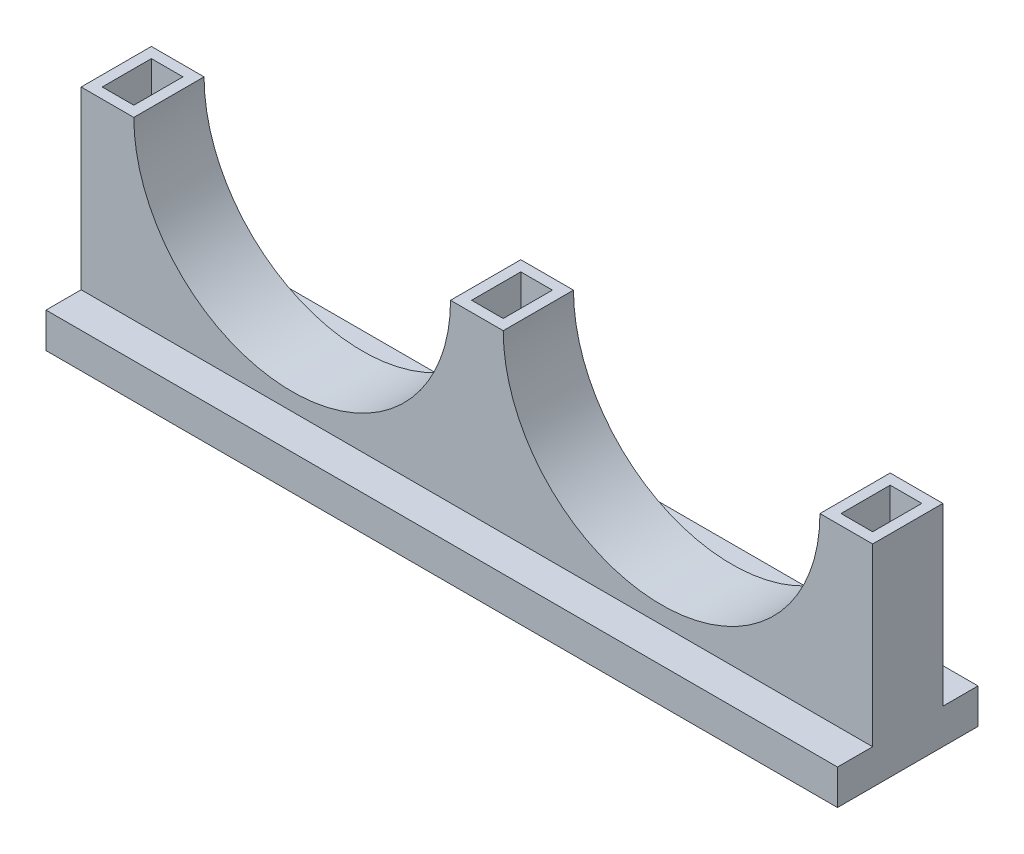
ISO-10303-21;
HEADER;
FILE_DESCRIPTION(('STEP AP214'),'2;1');
FILE_NAME('part.step','',(''),(''),'','','');
FILE_SCHEMA(('AUTOMOTIVE_DESIGN { 1 0 10303 214 1 1 1 1 }'));
ENDSEC;
DATA;
#1=APPLICATION_CONTEXT('core data for automotive mechanical design processes');
#2=APPLICATION_PROTOCOL_DEFINITION('international standard','automotive_design',2000,#1);
#3=PRODUCT_CONTEXT('',#1,'mechanical');
#4=PRODUCT('Part','Part','',(#3));
#5=PRODUCT_RELATED_PRODUCT_CATEGORY('part','',(#4));
#6=PRODUCT_DEFINITION_FORMATION('','',#4);
#7=PRODUCT_DEFINITION_CONTEXT('part definition',#1,'design');
#8=PRODUCT_DEFINITION('design','',#6,#7);
#9=PRODUCT_DEFINITION_SHAPE('','',#8);
#10=(LENGTH_UNIT() NAMED_UNIT(*) SI_UNIT(.MILLI.,.METRE.));
#11=(NAMED_UNIT(*) PLANE_ANGLE_UNIT() SI_UNIT($,.RADIAN.));
#12=(NAMED_UNIT(*) SI_UNIT($,.STERADIAN.) SOLID_ANGLE_UNIT());
#13=UNCERTAINTY_MEASURE_WITH_UNIT(LENGTH_MEASURE(1.E-05),#10,'distance_accuracy_value','');
#14=(GEOMETRIC_REPRESENTATION_CONTEXT(3) GLOBAL_UNCERTAINTY_ASSIGNED_CONTEXT((#13)) GLOBAL_UNIT_ASSIGNED_CONTEXT((#10,
#11,#12)) REPRESENTATION_CONTEXT('',''));
#15=CARTESIAN_POINT('',(0.,0.,0.));
#16=DIRECTION('',(0.,0.,1.));
#17=DIRECTION('',(1.,0.,0.));
#18=AXIS2_PLACEMENT_3D('',#15,#16,#17);
#19=CARTESIAN_POINT('',(0.,0.,20.));
#20=DIRECTION('',(0.,1.,0.));
#21=DIRECTION('',(0.,0.,1.));
#22=AXIS2_PLACEMENT_3D('',#19,#20,#21);
#23=PLANE('',#22);
#24=DIRECTION('',(0.,0.,-1.));
#25=VECTOR('',#24,1.);
#26=CARTESIAN_POINT('',(0.,0.,20.));
#27=LINE('',#26,#25);
#28=CARTESIAN_POINT('',(0.,0.,30.));
#29=VERTEX_POINT('',#28);
#30=CARTESIAN_POINT('',(0.,0.,-10.));
#31=VERTEX_POINT('',#30);
#32=EDGE_CURVE('E53',#29,#31,#27,.T.);
#33=ORIENTED_EDGE('',*,*,#32,.T.);
#34=DIRECTION('',(1.,0.,0.));
#35=VECTOR('',#34,1.);
#36=CARTESIAN_POINT('',(225.34,0.,-10.));
#37=LINE('',#36,#35);
#38=CARTESIAN_POINT('',(225.34,0.,-10.));
#39=VERTEX_POINT('',#38);
#40=EDGE_CURVE('E215',#31,#39,#37,.T.);
#41=ORIENTED_EDGE('',*,*,#40,.T.);
#42=DIRECTION('',(0.,0.,-1.));
#43=VECTOR('',#42,1.);
#44=CARTESIAN_POINT('',(225.34,0.,20.));
#45=LINE('',#44,#43);
#46=CARTESIAN_POINT('',(225.34,0.,30.));
#47=VERTEX_POINT('',#46);
#48=EDGE_CURVE('E458',#47,#39,#45,.T.);
#49=ORIENTED_EDGE('',*,*,#48,.F.);
#50=DIRECTION('',(1.,0.,0.));
#51=VECTOR('',#50,1.);
#52=CARTESIAN_POINT('',(225.34,0.,30.));
#53=LINE('',#52,#51);
#54=EDGE_CURVE('E231',#29,#47,#53,.T.);
#55=ORIENTED_EDGE('',*,*,#54,.F.);
#56=EDGE_LOOP('',(#33,#41,#49,#55));
#57=FACE_BOUND('',#56,.T.);
#58=ADVANCED_FACE('F45',(#57),#23,.F.);
#59=CARTESIAN_POINT('',(225.34,60.,20.));
#60=DIRECTION('',(-1.,0.,0.));
#61=DIRECTION('',(0.,0.,1.));
#62=AXIS2_PLACEMENT_3D('',#59,#60,#61);
#63=PLANE('',#62);
#64=DIRECTION('',(0.,1.,0.));
#65=VECTOR('',#64,1.);
#66=CARTESIAN_POINT('',(225.34,60.,20.));
#67=LINE('',#66,#65);
#68=CARTESIAN_POINT('',(225.34,10.,20.));
#69=VERTEX_POINT('',#68);
#70=CARTESIAN_POINT('',(225.34,60.,20.));
#71=VERTEX_POINT('',#70);
#72=EDGE_CURVE('E211',#69,#71,#67,.T.);
#73=ORIENTED_EDGE('',*,*,#72,.F.);
#74=DIRECTION('',(0.,0.,1.));
#75=VECTOR('',#74,1.);
#76=CARTESIAN_POINT('',(225.34,10.,-10.));
#77=LINE('',#76,#75);
#78=CARTESIAN_POINT('',(225.34,10.,30.));
#79=VERTEX_POINT('',#78);
#80=EDGE_CURVE('E205',#69,#79,#77,.T.);
#81=ORIENTED_EDGE('',*,*,#80,.T.);
#82=DIRECTION('',(0.,1.,0.));
#83=VECTOR('',#82,1.);
#84=CARTESIAN_POINT('',(225.34,0.,30.));
#85=LINE('',#84,#83);
#86=EDGE_CURVE('E209',#47,#79,#85,.T.);
#87=ORIENTED_EDGE('',*,*,#86,.F.);
#88=ORIENTED_EDGE('',*,*,#48,.T.);
#89=DIRECTION('',(0.,1.,0.));
#90=VECTOR('',#89,1.);
#91=CARTESIAN_POINT('',(225.34,0.,-10.));
#92=LINE('',#91,#90);
#93=CARTESIAN_POINT('',(225.34,10.,-10.));
#94=VERTEX_POINT('',#93);
#95=EDGE_CURVE('E239',#39,#94,#92,.T.);
#96=ORIENTED_EDGE('',*,*,#95,.T.);
#97=CARTESIAN_POINT('',(225.34,10.,0.));
#98=VERTEX_POINT('',#97);
#99=EDGE_CURVE('E214',#94,#98,#77,.T.);
#100=ORIENTED_EDGE('',*,*,#99,.T.);
#101=DIRECTION('',(0.,1.,0.));
#102=VECTOR('',#101,1.);
#103=CARTESIAN_POINT('',(225.34,60.,0.));
#104=LINE('',#103,#102);
#105=CARTESIAN_POINT('',(225.34,60.,0.));
#106=VERTEX_POINT('',#105);
#107=EDGE_CURVE('E280',#98,#106,#104,.T.);
#108=ORIENTED_EDGE('',*,*,#107,.T.);
#109=DIRECTION('',(0.,0.,-1.));
#110=VECTOR('',#109,1.);
#111=CARTESIAN_POINT('',(225.34,60.,20.));
#112=LINE('',#111,#110);
#113=EDGE_CURVE('E454',#71,#106,#112,.T.);
#114=ORIENTED_EDGE('',*,*,#113,.F.);
#115=EDGE_LOOP('',(#73,#81,#87,#88,#96,#100,#108,#114));
#116=FACE_BOUND('',#115,.T.);
#117=ADVANCED_FACE('F207',(#116),#63,.F.);
#118=CARTESIAN_POINT('',(210.34,60.,20.));
#119=DIRECTION('',(0.,-1.,0.));
#120=DIRECTION('',(0.,0.,-1.));
#121=AXIS2_PLACEMENT_3D('',#118,#119,#120);
#122=PLANE('',#121);
#123=DIRECTION('',(1.,0.,0.));
#124=VECTOR('',#123,1.);
#125=CARTESIAN_POINT('',(213.34,59.9999999999999,17.));
#126=LINE('',#125,#124);
#127=CARTESIAN_POINT('',(213.34,60.,17.));
#128=VERTEX_POINT('',#127);
#129=CARTESIAN_POINT('',(222.34,59.9999999999999,17.));
#130=VERTEX_POINT('',#129);
#131=EDGE_CURVE('E344',#128,#130,#126,.T.);
#132=ORIENTED_EDGE('',*,*,#131,.F.);
#133=DIRECTION('',(0.,0.,1.));
#134=VECTOR('',#133,1.);
#135=CARTESIAN_POINT('',(213.34,59.9999999999999,3.));
#136=LINE('',#135,#134);
#137=CARTESIAN_POINT('',(213.34,59.9999999999999,3.));
#138=VERTEX_POINT('',#137);
#139=EDGE_CURVE('E264',#138,#128,#136,.T.);
#140=ORIENTED_EDGE('',*,*,#139,.F.);
#141=DIRECTION('',(-1.,0.,0.));
#142=VECTOR('',#141,1.);
#143=CARTESIAN_POINT('',(222.34,59.9999999999999,3.));
#144=LINE('',#143,#142);
#145=CARTESIAN_POINT('',(222.34,59.9999999999999,3.));
#146=VERTEX_POINT('',#145);
#147=EDGE_CURVE('E323',#146,#138,#144,.T.);
#148=ORIENTED_EDGE('',*,*,#147,.F.);
#149=DIRECTION('',(0.,0.,-1.));
#150=VECTOR('',#149,1.);
#151=CARTESIAN_POINT('',(222.34,59.9999999999999,17.));
#152=LINE('',#151,#150);
#153=EDGE_CURVE('E340',#130,#146,#152,.T.);
#154=ORIENTED_EDGE('',*,*,#153,.F.);
#155=EDGE_LOOP('',(#132,#140,#148,#154));
#156=FACE_BOUND('',#155,.T.);
#157=DIRECTION('',(-1.,0.,0.));
#158=VECTOR('',#157,1.);
#159=CARTESIAN_POINT('',(210.34,60.,0.));
#160=LINE('',#159,#158);
#161=CARTESIAN_POINT('',(210.34,60.,0.));
#162=VERTEX_POINT('',#161);
#163=EDGE_CURVE('E417',#106,#162,#160,.T.);
#164=ORIENTED_EDGE('',*,*,#163,.T.);
#165=DIRECTION('',(0.,0.,-1.));
#166=VECTOR('',#165,1.);
#167=CARTESIAN_POINT('',(210.34,60.,20.));
#168=LINE('',#167,#166);
#169=CARTESIAN_POINT('',(210.34,60.,20.));
#170=VERTEX_POINT('',#169);
#171=EDGE_CURVE('E450',#170,#162,#168,.T.);
#172=ORIENTED_EDGE('',*,*,#171,.F.);
#173=DIRECTION('',(-1.,0.,0.));
#174=VECTOR('',#173,1.);
#175=CARTESIAN_POINT('',(210.34,60.,20.));
#176=LINE('',#175,#174);
#177=EDGE_CURVE('E398',#71,#170,#176,.T.);
#178=ORIENTED_EDGE('',*,*,#177,.F.);
#179=ORIENTED_EDGE('',*,*,#113,.T.);
#180=EDGE_LOOP('',(#164,#172,#178,#179));
#181=FACE_BOUND('',#180,.T.);
#182=ADVANCED_FACE('F479',(#156,#181),#122,.F.);
#183=CARTESIAN_POINT('',(165.255,60.,20.));
#184=DIRECTION('',(0.,0.,-1.));
#185=DIRECTION('',(-1.,0.,0.));
#186=AXIS2_PLACEMENT_3D('',#183,#184,#185);
#187=CYLINDRICAL_SURFACE('',#186,45.085);
#188=CARTESIAN_POINT('',(165.255,60.,0.));
#189=DIRECTION('',(0.,0.,-1.));
#190=DIRECTION('',(1.,0.,0.));
#191=AXIS2_PLACEMENT_3D('',#188,#189,#190);
#192=CIRCLE('',#191,45.085);
#193=CARTESIAN_POINT('',(120.17,60.,0.));
#194=VERTEX_POINT('',#193);
#195=EDGE_CURVE('E420',#162,#194,#192,.T.);
#196=ORIENTED_EDGE('',*,*,#195,.T.);
#197=DIRECTION('',(0.,0.,-1.));
#198=VECTOR('',#197,1.);
#199=CARTESIAN_POINT('',(120.17,60.,20.));
#200=LINE('',#199,#198);
#201=CARTESIAN_POINT('',(120.17,60.,20.));
#202=VERTEX_POINT('',#201);
#203=EDGE_CURVE('E446',#202,#194,#200,.T.);
#204=ORIENTED_EDGE('',*,*,#203,.F.);
#205=CARTESIAN_POINT('',(165.255,60.,20.));
#206=DIRECTION('',(0.,0.,-1.));
#207=DIRECTION('',(1.,0.,0.));
#208=AXIS2_PLACEMENT_3D('',#205,#206,#207);
#209=CIRCLE('',#208,45.085);
#210=EDGE_CURVE('E401',#170,#202,#209,.T.);
#211=ORIENTED_EDGE('',*,*,#210,.F.);
#212=ORIENTED_EDGE('',*,*,#171,.T.);
#213=EDGE_LOOP('',(#196,#204,#211,#212));
#214=FACE_BOUND('',#213,.T.);
#215=ADVANCED_FACE('F483',(#214),#187,.F.);
#216=CARTESIAN_POINT('',(105.17,60.,20.));
#217=DIRECTION('',(0.,-1.,0.));
#218=DIRECTION('',(0.,0.,-1.));
#219=AXIS2_PLACEMENT_3D('',#216,#217,#218);
#220=PLANE('',#219);
#221=DIRECTION('',(1.,0.,0.));
#222=VECTOR('',#221,1.);
#223=CARTESIAN_POINT('',(108.17,60.,17.));
#224=LINE('',#223,#222);
#225=CARTESIAN_POINT('',(108.17,60.,17.));
#226=VERTEX_POINT('',#225);
#227=CARTESIAN_POINT('',(117.17,60.,17.));
#228=VERTEX_POINT('',#227);
#229=EDGE_CURVE('E386',#226,#228,#224,.T.);
#230=ORIENTED_EDGE('',*,*,#229,.F.);
#231=DIRECTION('',(0.,0.,1.));
#232=VECTOR('',#231,1.);
#233=CARTESIAN_POINT('',(108.17,60.,3.));
#234=LINE('',#233,#232);
#235=CARTESIAN_POINT('',(108.17,60.,3.));
#236=VERTEX_POINT('',#235);
#237=EDGE_CURVE('E336',#236,#226,#234,.T.);
#238=ORIENTED_EDGE('',*,*,#237,.F.);
#239=DIRECTION('',(-1.,0.,0.));
#240=VECTOR('',#239,1.);
#241=CARTESIAN_POINT('',(117.17,60.,3.));
#242=LINE('',#241,#240);
#243=CARTESIAN_POINT('',(117.17,60.,3.));
#244=VERTEX_POINT('',#243);
#245=EDGE_CURVE('E367',#244,#236,#242,.T.);
#246=ORIENTED_EDGE('',*,*,#245,.F.);
#247=DIRECTION('',(0.,0.,-1.));
#248=VECTOR('',#247,1.);
#249=CARTESIAN_POINT('',(117.17,60.,17.));
#250=LINE('',#249,#248);
#251=EDGE_CURVE('E382',#228,#244,#250,.T.);
#252=ORIENTED_EDGE('',*,*,#251,.F.);
#253=EDGE_LOOP('',(#230,#238,#246,#252));
#254=FACE_BOUND('',#253,.T.);
#255=DIRECTION('',(-1.,0.,0.));
#256=VECTOR('',#255,1.);
#257=CARTESIAN_POINT('',(105.17,60.,0.));
#258=LINE('',#257,#256);
#259=CARTESIAN_POINT('',(105.17,60.,0.));
#260=VERTEX_POINT('',#259);
#261=EDGE_CURVE('E423',#194,#260,#258,.T.);
#262=ORIENTED_EDGE('',*,*,#261,.T.);
#263=DIRECTION('',(0.,0.,-1.));
#264=VECTOR('',#263,1.);
#265=CARTESIAN_POINT('',(105.17,60.,20.));
#266=LINE('',#265,#264);
#267=CARTESIAN_POINT('',(105.17,60.,20.));
#268=VERTEX_POINT('',#267);
#269=EDGE_CURVE('E442',#268,#260,#266,.T.);
#270=ORIENTED_EDGE('',*,*,#269,.F.);
#271=DIRECTION('',(-1.,0.,0.));
#272=VECTOR('',#271,1.);
#273=CARTESIAN_POINT('',(105.17,60.,20.));
#274=LINE('',#273,#272);
#275=EDGE_CURVE('E404',#202,#268,#274,.T.);
#276=ORIENTED_EDGE('',*,*,#275,.F.);
#277=ORIENTED_EDGE('',*,*,#203,.T.);
#278=EDGE_LOOP('',(#262,#270,#276,#277));
#279=FACE_BOUND('',#278,.T.);
#280=ADVANCED_FACE('F491',(#254,#279),#220,.F.);
#281=CARTESIAN_POINT('',(60.085,60.,20.));
#282=DIRECTION('',(0.,0.,-1.));
#283=DIRECTION('',(-1.,0.,0.));
#284=AXIS2_PLACEMENT_3D('',#281,#282,#283);
#285=CYLINDRICAL_SURFACE('',#284,45.085);
#286=CARTESIAN_POINT('',(60.085,60.,0.));
#287=DIRECTION('',(0.,0.,-1.));
#288=DIRECTION('',(1.,0.,0.));
#289=AXIS2_PLACEMENT_3D('',#286,#287,#288);
#290=CIRCLE('',#289,45.085);
#291=CARTESIAN_POINT('',(15.,60.,0.));
#292=VERTEX_POINT('',#291);
#293=EDGE_CURVE('E426',#260,#292,#290,.T.);
#294=ORIENTED_EDGE('',*,*,#293,.T.);
#295=DIRECTION('',(0.,0.,-1.));
#296=VECTOR('',#295,1.);
#297=CARTESIAN_POINT('',(15.,60.,20.));
#298=LINE('',#297,#296);
#299=CARTESIAN_POINT('',(15.,60.,20.));
#300=VERTEX_POINT('',#299);
#301=EDGE_CURVE('E438',#300,#292,#298,.T.);
#302=ORIENTED_EDGE('',*,*,#301,.F.);
#303=CARTESIAN_POINT('',(60.085,60.,20.));
#304=DIRECTION('',(0.,0.,-1.));
#305=DIRECTION('',(1.,0.,0.));
#306=AXIS2_PLACEMENT_3D('',#303,#304,#305);
#307=CIRCLE('',#306,45.085);
#308=EDGE_CURVE('E407',#268,#300,#307,.T.);
#309=ORIENTED_EDGE('',*,*,#308,.F.);
#310=ORIENTED_EDGE('',*,*,#269,.T.);
#311=EDGE_LOOP('',(#294,#302,#309,#310));
#312=FACE_BOUND('',#311,.T.);
#313=ADVANCED_FACE('F494',(#312),#285,.F.);
#314=CARTESIAN_POINT('',(0.,60.,20.));
#315=DIRECTION('',(0.,-1.,0.));
#316=DIRECTION('',(1.,0.,0.));
#317=AXIS2_PLACEMENT_3D('',#314,#315,#316);
#318=PLANE('',#317);
#319=DIRECTION('',(-1.,0.,0.));
#320=VECTOR('',#319,1.);
#321=CARTESIAN_POINT('',(12.,60.,3.));
#322=LINE('',#321,#320);
#323=CARTESIAN_POINT('',(12.,60.,3.));
#324=VERTEX_POINT('',#323);
#325=CARTESIAN_POINT('',(3.,60.,3.));
#326=VERTEX_POINT('',#325);
#327=EDGE_CURVE('E263',#324,#326,#322,.T.);
#328=ORIENTED_EDGE('',*,*,#327,.F.);
#329=DIRECTION('',(0.,0.,-1.));
#330=VECTOR('',#329,1.);
#331=CARTESIAN_POINT('',(12.,60.,17.));
#332=LINE('',#331,#330);
#333=CARTESIAN_POINT('',(12.,60.,17.));
#334=VERTEX_POINT('',#333);
#335=EDGE_CURVE('E260',#334,#324,#332,.T.);
#336=ORIENTED_EDGE('',*,*,#335,.F.);
#337=DIRECTION('',(1.,0.,0.));
#338=VECTOR('',#337,1.);
#339=CARTESIAN_POINT('',(3.,60.,17.));
#340=LINE('',#339,#338);
#341=CARTESIAN_POINT('',(3.,60.,17.));
#342=VERTEX_POINT('',#341);
#343=EDGE_CURVE('E272',#342,#334,#340,.T.);
#344=ORIENTED_EDGE('',*,*,#343,.F.);
#345=DIRECTION('',(0.,0.,1.));
#346=VECTOR('',#345,1.);
#347=CARTESIAN_POINT('',(3.,60.,3.));
#348=LINE('',#347,#346);
#349=EDGE_CURVE('E268',#326,#342,#348,.T.);
#350=ORIENTED_EDGE('',*,*,#349,.F.);
#351=EDGE_LOOP('',(#328,#336,#344,#350));
#352=FACE_BOUND('',#351,.T.);
#353=DIRECTION('',(-1.,0.,0.));
#354=VECTOR('',#353,1.);
#355=CARTESIAN_POINT('',(0.,60.,0.));
#356=LINE('',#355,#354);
#357=CARTESIAN_POINT('',(0.,60.,0.));
#358=VERTEX_POINT('',#357);
#359=EDGE_CURVE('E429',#292,#358,#356,.T.);
#360=ORIENTED_EDGE('',*,*,#359,.T.);
#361=DIRECTION('',(0.,0.,-1.));
#362=VECTOR('',#361,1.);
#363=CARTESIAN_POINT('',(0.,60.,20.));
#364=LINE('',#363,#362);
#365=CARTESIAN_POINT('',(0.,60.,20.));
#366=VERTEX_POINT('',#365);
#367=EDGE_CURVE('E414',#366,#358,#364,.T.);
#368=ORIENTED_EDGE('',*,*,#367,.F.);
#369=DIRECTION('',(-1.,0.,0.));
#370=VECTOR('',#369,1.);
#371=CARTESIAN_POINT('',(0.,60.,20.));
#372=LINE('',#371,#370);
#373=EDGE_CURVE('E410',#300,#366,#372,.T.);
#374=ORIENTED_EDGE('',*,*,#373,.F.);
#375=ORIENTED_EDGE('',*,*,#301,.T.);
#376=EDGE_LOOP('',(#360,#368,#374,#375));
#377=FACE_BOUND('',#376,.T.);
#378=ADVANCED_FACE('F499',(#352,#377),#318,.F.);
#379=CARTESIAN_POINT('',(0.,10.,20.));
#380=DIRECTION('',(1.,0.,0.));
#381=DIRECTION('',(0.,0.,-1.));
#382=AXIS2_PLACEMENT_3D('',#379,#380,#381);
#383=PLANE('',#382);
#384=DIRECTION('',(0.,-1.,0.));
#385=VECTOR('',#384,1.);
#386=CARTESIAN_POINT('',(0.,10.,0.));
#387=LINE('',#386,#385);
#388=CARTESIAN_POINT('',(0.,9.99999999999999,0.));
#389=VERTEX_POINT('',#388);
#390=EDGE_CURVE('E395',#358,#389,#387,.T.);
#391=ORIENTED_EDGE('',*,*,#390,.T.);
#392=DIRECTION('',(0.,0.,1.));
#393=VECTOR('',#392,1.);
#394=CARTESIAN_POINT('',(0.,9.99999999999997,-10.));
#395=LINE('',#394,#393);
#396=CARTESIAN_POINT('',(0.,9.99999999999997,-10.));
#397=VERTEX_POINT('',#396);
#398=EDGE_CURVE('E68',#397,#389,#395,.T.);
#399=ORIENTED_EDGE('',*,*,#398,.F.);
#400=DIRECTION('',(0.,-1.,0.));
#401=VECTOR('',#400,1.);
#402=CARTESIAN_POINT('',(0.,0.,-10.));
#403=LINE('',#402,#401);
#404=EDGE_CURVE('E246',#397,#31,#403,.T.);
#405=ORIENTED_EDGE('',*,*,#404,.T.);
#406=ORIENTED_EDGE('',*,*,#32,.F.);
#407=DIRECTION('',(0.,-1.,0.));
#408=VECTOR('',#407,1.);
#409=CARTESIAN_POINT('',(0.,0.,30.));
#410=LINE('',#409,#408);
#411=CARTESIAN_POINT('',(0.,9.99999999999997,30.));
#412=VERTEX_POINT('',#411);
#413=EDGE_CURVE('E226',#412,#29,#410,.T.);
#414=ORIENTED_EDGE('',*,*,#413,.F.);
#415=CARTESIAN_POINT('',(0.,9.99999999999997,20.));
#416=VERTEX_POINT('',#415);
#417=EDGE_CURVE('E221',#416,#412,#395,.T.);
#418=ORIENTED_EDGE('',*,*,#417,.F.);
#419=DIRECTION('',(0.,-1.,0.));
#420=VECTOR('',#419,1.);
#421=CARTESIAN_POINT('',(0.,10.,20.));
#422=LINE('',#421,#420);
#423=EDGE_CURVE('E392',#366,#416,#422,.T.);
#424=ORIENTED_EDGE('',*,*,#423,.F.);
#425=ORIENTED_EDGE('',*,*,#367,.T.);
#426=EDGE_LOOP('',(#391,#399,#405,#406,#414,#418,#424,#425));
#427=FACE_BOUND('',#426,.T.);
#428=ADVANCED_FACE('F465',(#427),#383,.F.);
#429=CARTESIAN_POINT('',(165.255,60.,20.));
#430=DIRECTION('',(0.,0.,1.));
#431=DIRECTION('',(1.,0.,0.));
#432=AXIS2_PLACEMENT_3D('',#429,#430,#431);
#433=PLANE('',#432);
#434=DIRECTION('',(-1.,0.,0.));
#435=VECTOR('',#434,1.);
#436=CARTESIAN_POINT('',(165.255,9.99999999999999,20.));
#437=LINE('',#436,#435);
#438=EDGE_CURVE('E60',#69,#416,#437,.T.);
#439=ORIENTED_EDGE('',*,*,#438,.F.);
#440=ORIENTED_EDGE('',*,*,#72,.T.);
#441=ORIENTED_EDGE('',*,*,#177,.T.);
#442=ORIENTED_EDGE('',*,*,#210,.T.);
#443=ORIENTED_EDGE('',*,*,#275,.T.);
#444=ORIENTED_EDGE('',*,*,#308,.T.);
#445=ORIENTED_EDGE('',*,*,#373,.T.);
#446=ORIENTED_EDGE('',*,*,#423,.T.);
#447=EDGE_LOOP('',(#439,#440,#441,#442,#443,#444,#445,#446));
#448=FACE_BOUND('',#447,.T.);
#449=ADVANCED_FACE('F486',(#448),#433,.T.);
#450=CARTESIAN_POINT('',(165.255,60.,0.));
#451=DIRECTION('',(0.,0.,1.));
#452=DIRECTION('',(1.,0.,0.));
#453=AXIS2_PLACEMENT_3D('',#450,#451,#452);
#454=PLANE('',#453);
#455=ORIENTED_EDGE('',*,*,#107,.F.);
#456=DIRECTION('',(-1.,0.,0.));
#457=VECTOR('',#456,1.);
#458=CARTESIAN_POINT('',(165.255,9.99999999999999,0.));
#459=LINE('',#458,#457);
#460=EDGE_CURVE('E11',#98,#389,#459,.T.);
#461=ORIENTED_EDGE('',*,*,#460,.T.);
#462=ORIENTED_EDGE('',*,*,#390,.F.);
#463=ORIENTED_EDGE('',*,*,#359,.F.);
#464=ORIENTED_EDGE('',*,*,#293,.F.);
#465=ORIENTED_EDGE('',*,*,#261,.F.);
#466=ORIENTED_EDGE('',*,*,#195,.F.);
#467=ORIENTED_EDGE('',*,*,#163,.F.);
#468=EDGE_LOOP('',(#455,#461,#462,#463,#464,#465,#466,#467));
#469=FACE_BOUND('',#468,.T.);
#470=ADVANCED_FACE('F473',(#469),#454,.F.);
#471=CARTESIAN_POINT('',(12.,60.,17.));
#472=DIRECTION('',(0.999847695156391,-0.017452406437284,0.));
#473=DIRECTION('',(0.017452406437284,0.999847695156391,0.));
#474=AXIS2_PLACEMENT_3D('',#471,#472,#473);
#475=PLANE('',#474);
#476=ORIENTED_EDGE('',*,*,#335,.T.);
#477=DIRECTION('',(0.0174497491606832,0.999695459881887,-0.0174497491606827));
#478=VECTOR('',#477,1.);
#479=CARTESIAN_POINT('',(11.9957370875592,59.7557779098318,3.00426291244079));
#480=LINE('',#479,#478);
#481=CARTESIAN_POINT('',(11.8254493507178,50.,3.17455064928218));
#482=VERTEX_POINT('',#481);
#483=EDGE_CURVE('E282',#482,#324,#480,.T.);
#484=ORIENTED_EDGE('',*,*,#483,.F.);
#485=DIRECTION('',(0.,0.,-1.));
#486=VECTOR('',#485,1.);
#487=CARTESIAN_POINT('',(11.8254493507178,50.,0.));
#488=LINE('',#487,#486);
#489=CARTESIAN_POINT('',(11.8254493507178,50.,16.8254493507178));
#490=VERTEX_POINT('',#489);
#491=EDGE_CURVE('E276',#490,#482,#488,.T.);
#492=ORIENTED_EDGE('',*,*,#491,.F.);
#493=DIRECTION('',(0.0174497491606832,0.999695459881887,0.0174497491606827));
#494=VECTOR('',#493,1.);
#495=CARTESIAN_POINT('',(11.9972595562881,59.8430000848919,16.9972595562881));
#496=LINE('',#495,#494);
#497=EDGE_CURVE('E277',#490,#334,#496,.T.);
#498=ORIENTED_EDGE('',*,*,#497,.T.);
#499=EDGE_LOOP('',(#476,#484,#492,#498));
#500=FACE_BOUND('',#499,.T.);
#501=ADVANCED_FACE('F563',(#500),#475,.F.);
#502=CARTESIAN_POINT('',(3.,60.,17.));
#503=DIRECTION('',(0.,-0.0174524064372835,0.999847695156391));
#504=DIRECTION('',(0.,-0.999847695156391,-0.0174524064372835));
#505=AXIS2_PLACEMENT_3D('',#502,#503,#504);
#506=PLANE('',#505);
#507=ORIENTED_EDGE('',*,*,#343,.T.);
#508=ORIENTED_EDGE('',*,*,#497,.F.);
#509=DIRECTION('',(1.,0.,0.));
#510=VECTOR('',#509,1.);
#511=CARTESIAN_POINT('',(0.,50.,16.8254493507178));
#512=LINE('',#511,#510);
#513=CARTESIAN_POINT('',(3.17455064928217,50.,16.8254493507178));
#514=VERTEX_POINT('',#513);
#515=EDGE_CURVE('E287',#514,#490,#512,.T.);
#516=ORIENTED_EDGE('',*,*,#515,.F.);
#517=DIRECTION('',(-0.0174497491606823,0.999695459881887,0.0174497491606827));
#518=VECTOR('',#517,1.);
#519=CARTESIAN_POINT('',(3.00426291244079,59.7557779098318,16.9957370875592));
#520=LINE('',#519,#518);
#521=EDGE_CURVE('E281',#514,#342,#520,.T.);
#522=ORIENTED_EDGE('',*,*,#521,.T.);
#523=EDGE_LOOP('',(#507,#508,#516,#522));
#524=FACE_BOUND('',#523,.T.);
#525=ADVANCED_FACE('F567',(#524),#506,.F.);
#526=CARTESIAN_POINT('',(3.,60.,3.));
#527=DIRECTION('',(-0.999847695156391,-0.0174524064372831,0.));
#528=DIRECTION('',(0.0174524064372831,-0.999847695156391,0.));
#529=AXIS2_PLACEMENT_3D('',#526,#527,#528);
#530=PLANE('',#529);
#531=ORIENTED_EDGE('',*,*,#349,.T.);
#532=ORIENTED_EDGE('',*,*,#521,.F.);
#533=DIRECTION('',(0.,0.,1.));
#534=VECTOR('',#533,1.);
#535=CARTESIAN_POINT('',(3.17455064928217,50.,0.));
#536=LINE('',#535,#534);
#537=CARTESIAN_POINT('',(3.17455064928217,50.,3.17455064928218));
#538=VERTEX_POINT('',#537);
#539=EDGE_CURVE('E299',#538,#514,#536,.T.);
#540=ORIENTED_EDGE('',*,*,#539,.F.);
#541=DIRECTION('',(-0.0174497491606823,0.999695459881887,-0.0174497491606827));
#542=VECTOR('',#541,1.);
#543=CARTESIAN_POINT('',(3.00274044371194,59.8430000848919,3.00274044371194));
#544=LINE('',#543,#542);
#545=EDGE_CURVE('E286',#538,#326,#544,.T.);
#546=ORIENTED_EDGE('',*,*,#545,.T.);
#547=EDGE_LOOP('',(#531,#532,#540,#546));
#548=FACE_BOUND('',#547,.T.);
#549=ADVANCED_FACE('F573',(#548),#530,.F.);
#550=CARTESIAN_POINT('',(12.,60.,3.));
#551=DIRECTION('',(0.,-0.0174524064372835,-0.999847695156391));
#552=DIRECTION('',(0.,0.999847695156391,-0.0174524064372835));
#553=AXIS2_PLACEMENT_3D('',#550,#551,#552);
#554=PLANE('',#553);
#555=ORIENTED_EDGE('',*,*,#327,.T.);
#556=ORIENTED_EDGE('',*,*,#545,.F.);
#557=DIRECTION('',(-1.,0.,0.));
#558=VECTOR('',#557,1.);
#559=CARTESIAN_POINT('',(0.,50.,3.17455064928218));
#560=LINE('',#559,#558);
#561=EDGE_CURVE('E295',#482,#538,#560,.T.);
#562=ORIENTED_EDGE('',*,*,#561,.F.);
#563=ORIENTED_EDGE('',*,*,#483,.T.);
#564=EDGE_LOOP('',(#555,#556,#562,#563));
#565=FACE_BOUND('',#564,.T.);
#566=ADVANCED_FACE('F580',(#565),#554,.F.);
#567=CARTESIAN_POINT('',(0.,50.,0.));
#568=DIRECTION('',(0.,1.,0.));
#569=DIRECTION('',(-1.,0.,0.));
#570=AXIS2_PLACEMENT_3D('',#567,#568,#569);
#571=PLANE('',#570);
#572=ORIENTED_EDGE('',*,*,#491,.T.);
#573=ORIENTED_EDGE('',*,*,#561,.T.);
#574=ORIENTED_EDGE('',*,*,#539,.T.);
#575=ORIENTED_EDGE('',*,*,#515,.T.);
#576=EDGE_LOOP('',(#572,#573,#574,#575));
#577=FACE_BOUND('',#576,.T.);
#578=ADVANCED_FACE('F578',(#577),#571,.T.);
#579=CARTESIAN_POINT('',(108.17,60.,3.));
#580=DIRECTION('',(-0.999847695156391,-0.0174524064372831,0.));
#581=DIRECTION('',(0.0174524064372831,-0.999847695156391,0.));
#582=AXIS2_PLACEMENT_3D('',#579,#580,#581);
#583=PLANE('',#582);
#584=ORIENTED_EDGE('',*,*,#237,.T.);
#585=DIRECTION('',(-0.0174497491606823,0.999695459881887,0.0174497491606827));
#586=VECTOR('',#585,1.);
#587=CARTESIAN_POINT('',(108.174262912441,59.7557779098318,16.9957370875592));
#588=LINE('',#587,#586);
#589=CARTESIAN_POINT('',(108.344550649282,50.,16.8254493507178));
#590=VERTEX_POINT('',#589);
#591=EDGE_CURVE('E363',#590,#226,#588,.T.);
#592=ORIENTED_EDGE('',*,*,#591,.F.);
#593=DIRECTION('',(0.,0.,1.));
#594=VECTOR('',#593,1.);
#595=CARTESIAN_POINT('',(108.344550649282,50.,0.));
#596=LINE('',#595,#594);
#597=CARTESIAN_POINT('',(108.344550649282,50.,3.17455064928218));
#598=VERTEX_POINT('',#597);
#599=EDGE_CURVE('E354',#598,#590,#596,.T.);
#600=ORIENTED_EDGE('',*,*,#599,.F.);
#601=DIRECTION('',(-0.0174497491606823,0.999695459881887,-0.0174497491606827));
#602=VECTOR('',#601,1.);
#603=CARTESIAN_POINT('',(108.172740443712,59.8430000848918,3.00274044371194));
#604=LINE('',#603,#602);
#605=EDGE_CURVE('E259',#598,#236,#604,.T.);
#606=ORIENTED_EDGE('',*,*,#605,.T.);
#607=EDGE_LOOP('',(#584,#592,#600,#606));
#608=FACE_BOUND('',#607,.T.);
#609=ADVANCED_FACE('F539',(#608),#583,.F.);
#610=CARTESIAN_POINT('',(117.17,60.,3.));
#611=DIRECTION('',(0.,-0.0174524064372835,-0.999847695156391));
#612=DIRECTION('',(0.,0.999847695156391,-0.0174524064372835));
#613=AXIS2_PLACEMENT_3D('',#610,#611,#612);
#614=PLANE('',#613);
#615=ORIENTED_EDGE('',*,*,#245,.T.);
#616=ORIENTED_EDGE('',*,*,#605,.F.);
#617=DIRECTION('',(-1.,0.,0.));
#618=VECTOR('',#617,1.);
#619=CARTESIAN_POINT('',(0.,50.,3.17455064928218));
#620=LINE('',#619,#618);
#621=CARTESIAN_POINT('',(116.995449350718,50.,3.17455064928218));
#622=VERTEX_POINT('',#621);
#623=EDGE_CURVE('E359',#622,#598,#620,.T.);
#624=ORIENTED_EDGE('',*,*,#623,.F.);
#625=DIRECTION('',(0.0174497491606832,0.999695459881887,-0.0174497491606827));
#626=VECTOR('',#625,1.);
#627=CARTESIAN_POINT('',(117.165737087559,59.7557779098318,3.00426291244079));
#628=LINE('',#627,#626);
#629=EDGE_CURVE('E368',#622,#244,#628,.T.);
#630=ORIENTED_EDGE('',*,*,#629,.T.);
#631=EDGE_LOOP('',(#615,#616,#624,#630));
#632=FACE_BOUND('',#631,.T.);
#633=ADVANCED_FACE('F542',(#632),#614,.F.);
#634=CARTESIAN_POINT('',(117.17,60.,17.));
#635=DIRECTION('',(0.999847695156391,-0.017452406437284,0.));
#636=DIRECTION('',(0.017452406437284,0.999847695156391,0.));
#637=AXIS2_PLACEMENT_3D('',#634,#635,#636);
#638=PLANE('',#637);
#639=ORIENTED_EDGE('',*,*,#251,.T.);
#640=ORIENTED_EDGE('',*,*,#629,.F.);
#641=DIRECTION('',(0.,0.,-1.));
#642=VECTOR('',#641,1.);
#643=CARTESIAN_POINT('',(116.995449350718,50.,0.));
#644=LINE('',#643,#642);
#645=CARTESIAN_POINT('',(116.995449350718,50.,16.8254493507178));
#646=VERTEX_POINT('',#645);
#647=EDGE_CURVE('E355',#646,#622,#644,.T.);
#648=ORIENTED_EDGE('',*,*,#647,.F.);
#649=DIRECTION('',(0.0174497491606832,0.999695459881887,0.0174497491606827));
#650=VECTOR('',#649,1.);
#651=CARTESIAN_POINT('',(117.167259556288,59.8430000848918,16.9972595562881));
#652=LINE('',#651,#650);
#653=EDGE_CURVE('E371',#646,#228,#652,.T.);
#654=ORIENTED_EDGE('',*,*,#653,.T.);
#655=EDGE_LOOP('',(#639,#640,#648,#654));
#656=FACE_BOUND('',#655,.T.);
#657=ADVANCED_FACE('F544',(#656),#638,.F.);
#658=CARTESIAN_POINT('',(108.17,60.,17.));
#659=DIRECTION('',(0.,-0.0174524064372835,0.999847695156391));
#660=DIRECTION('',(0.,-0.999847695156391,-0.0174524064372835));
#661=AXIS2_PLACEMENT_3D('',#658,#659,#660);
#662=PLANE('',#661);
#663=ORIENTED_EDGE('',*,*,#229,.T.);
#664=ORIENTED_EDGE('',*,*,#653,.F.);
#665=DIRECTION('',(1.,0.,0.));
#666=VECTOR('',#665,1.);
#667=CARTESIAN_POINT('',(0.,50.,16.8254493507178));
#668=LINE('',#667,#666);
#669=EDGE_CURVE('E350',#590,#646,#668,.T.);
#670=ORIENTED_EDGE('',*,*,#669,.F.);
#671=ORIENTED_EDGE('',*,*,#591,.T.);
#672=EDGE_LOOP('',(#663,#664,#670,#671));
#673=FACE_BOUND('',#672,.T.);
#674=ADVANCED_FACE('F534',(#673),#662,.F.);
#675=CARTESIAN_POINT('',(0.,50.,0.));
#676=DIRECTION('',(0.,1.,0.));
#677=DIRECTION('',(-1.,0.,0.));
#678=AXIS2_PLACEMENT_3D('',#675,#676,#677);
#679=PLANE('',#678);
#680=ORIENTED_EDGE('',*,*,#599,.T.);
#681=ORIENTED_EDGE('',*,*,#669,.T.);
#682=ORIENTED_EDGE('',*,*,#647,.T.);
#683=ORIENTED_EDGE('',*,*,#623,.T.);
#684=EDGE_LOOP('',(#680,#681,#682,#683));
#685=FACE_BOUND('',#684,.T.);
#686=ADVANCED_FACE('F546',(#685),#679,.T.);
#687=CARTESIAN_POINT('',(213.34,59.9999999999999,3.));
#688=DIRECTION('',(-0.999847695156391,-0.0174524064372831,0.));
#689=DIRECTION('',(0.0174524064372831,-0.999847695156391,0.));
#690=AXIS2_PLACEMENT_3D('',#687,#688,#689);
#691=PLANE('',#690);
#692=ORIENTED_EDGE('',*,*,#139,.T.);
#693=DIRECTION('',(-0.0174497491606823,0.999695459881887,0.0174497491606827));
#694=VECTOR('',#693,1.);
#695=CARTESIAN_POINT('',(213.344262912441,59.7557779098317,16.9957370875592));
#696=LINE('',#695,#694);
#697=CARTESIAN_POINT('',(213.514550649282,49.9999999999999,16.8254493507178));
#698=VERTEX_POINT('',#697);
#699=EDGE_CURVE('E319',#698,#128,#696,.T.);
#700=ORIENTED_EDGE('',*,*,#699,.F.);
#701=DIRECTION('',(0.,0.,1.));
#702=VECTOR('',#701,1.);
#703=CARTESIAN_POINT('',(213.514550649282,49.9999999999999,0.));
#704=LINE('',#703,#702);
#705=CARTESIAN_POINT('',(213.514550649282,49.9999999999999,3.17455064928218));
#706=VERTEX_POINT('',#705);
#707=EDGE_CURVE('E310',#706,#698,#704,.T.);
#708=ORIENTED_EDGE('',*,*,#707,.F.);
#709=DIRECTION('',(-0.0174497491606823,0.999695459881887,-0.0174497491606827));
#710=VECTOR('',#709,1.);
#711=CARTESIAN_POINT('',(213.342740443712,59.8430000848918,3.00274044371194));
#712=LINE('',#711,#710);
#713=EDGE_CURVE('E328',#706,#138,#712,.T.);
#714=ORIENTED_EDGE('',*,*,#713,.T.);
#715=EDGE_LOOP('',(#692,#700,#708,#714));
#716=FACE_BOUND('',#715,.T.);
#717=ADVANCED_FACE('F548',(#716),#691,.F.);
#718=CARTESIAN_POINT('',(222.34,59.9999999999999,3.));
#719=DIRECTION('',(0.,-0.0174524064372835,-0.999847695156391));
#720=DIRECTION('',(0.,0.999847695156391,-0.0174524064372835));
#721=AXIS2_PLACEMENT_3D('',#718,#719,#720);
#722=PLANE('',#721);
#723=ORIENTED_EDGE('',*,*,#147,.T.);
#724=ORIENTED_EDGE('',*,*,#713,.F.);
#725=DIRECTION('',(-1.,0.,0.));
#726=VECTOR('',#725,1.);
#727=CARTESIAN_POINT('',(0.,50.0000000000001,3.17455064928218));
#728=LINE('',#727,#726);
#729=CARTESIAN_POINT('',(222.165449350718,49.9999999999999,3.17455064928218));
#730=VERTEX_POINT('',#729);
#731=EDGE_CURVE('E315',#730,#706,#728,.T.);
#732=ORIENTED_EDGE('',*,*,#731,.F.);
#733=DIRECTION('',(0.0174497491606832,0.999695459881887,-0.0174497491606827));
#734=VECTOR('',#733,1.);
#735=CARTESIAN_POINT('',(222.335737087559,59.7557779098317,3.00426291244079));
#736=LINE('',#735,#734);
#737=EDGE_CURVE('E324',#730,#146,#736,.T.);
#738=ORIENTED_EDGE('',*,*,#737,.T.);
#739=EDGE_LOOP('',(#723,#724,#732,#738));
#740=FACE_BOUND('',#739,.T.);
#741=ADVANCED_FACE('F554',(#740),#722,.F.);
#742=CARTESIAN_POINT('',(222.34,59.9999999999999,17.));
#743=DIRECTION('',(0.999847695156391,-0.017452406437284,0.));
#744=DIRECTION('',(0.017452406437284,0.999847695156391,0.));
#745=AXIS2_PLACEMENT_3D('',#742,#743,#744);
#746=PLANE('',#745);
#747=ORIENTED_EDGE('',*,*,#153,.T.);
#748=ORIENTED_EDGE('',*,*,#737,.F.);
#749=DIRECTION('',(0.,0.,-1.));
#750=VECTOR('',#749,1.);
#751=CARTESIAN_POINT('',(222.165449350718,49.9999999999999,0.));
#752=LINE('',#751,#750);
#753=CARTESIAN_POINT('',(222.165449350718,49.9999999999999,16.8254493507178));
#754=VERTEX_POINT('',#753);
#755=EDGE_CURVE('E311',#754,#730,#752,.T.);
#756=ORIENTED_EDGE('',*,*,#755,.F.);
#757=DIRECTION('',(0.0174497491606832,0.999695459881887,0.0174497491606827));
#758=VECTOR('',#757,1.);
#759=CARTESIAN_POINT('',(222.337259556288,59.8430000848918,16.9972595562881));
#760=LINE('',#759,#758);
#761=EDGE_CURVE('E327',#754,#130,#760,.T.);
#762=ORIENTED_EDGE('',*,*,#761,.T.);
#763=EDGE_LOOP('',(#747,#748,#756,#762));
#764=FACE_BOUND('',#763,.T.);
#765=ADVANCED_FACE('F589',(#764),#746,.F.);
#766=CARTESIAN_POINT('',(213.34,59.9999999999999,17.));
#767=DIRECTION('',(0.,-0.0174524064372835,0.999847695156391));
#768=DIRECTION('',(0.,-0.999847695156391,-0.0174524064372835));
#769=AXIS2_PLACEMENT_3D('',#766,#767,#768);
#770=PLANE('',#769);
#771=ORIENTED_EDGE('',*,*,#131,.T.);
#772=ORIENTED_EDGE('',*,*,#761,.F.);
#773=DIRECTION('',(1.,0.,0.));
#774=VECTOR('',#773,1.);
#775=CARTESIAN_POINT('',(0.,50.0000000000001,16.8254493507178));
#776=LINE('',#775,#774);
#777=EDGE_CURVE('E306',#698,#754,#776,.T.);
#778=ORIENTED_EDGE('',*,*,#777,.F.);
#779=ORIENTED_EDGE('',*,*,#699,.T.);
#780=EDGE_LOOP('',(#771,#772,#778,#779));
#781=FACE_BOUND('',#780,.T.);
#782=ADVANCED_FACE('F593',(#781),#770,.F.);
#783=CARTESIAN_POINT('',(0.,50.0000000000001,0.));
#784=DIRECTION('',(0.,1.,0.));
#785=DIRECTION('',(-1.,0.,0.));
#786=AXIS2_PLACEMENT_3D('',#783,#784,#785);
#787=PLANE('',#786);
#788=ORIENTED_EDGE('',*,*,#707,.T.);
#789=ORIENTED_EDGE('',*,*,#777,.T.);
#790=ORIENTED_EDGE('',*,*,#755,.T.);
#791=ORIENTED_EDGE('',*,*,#731,.T.);
#792=EDGE_LOOP('',(#788,#789,#790,#791));
#793=FACE_BOUND('',#792,.T.);
#794=ADVANCED_FACE('F596',(#793),#787,.T.);
#795=CARTESIAN_POINT('',(0.,0.,-10.));
#796=DIRECTION('',(0.,0.,1.));
#797=DIRECTION('',(1.,0.,0.));
#798=AXIS2_PLACEMENT_3D('',#795,#796,#797);
#799=PLANE('',#798);
#800=ORIENTED_EDGE('',*,*,#95,.F.);
#801=ORIENTED_EDGE('',*,*,#40,.F.);
#802=ORIENTED_EDGE('',*,*,#404,.F.);
#803=DIRECTION('',(-1.,0.,0.));
#804=VECTOR('',#803,1.);
#805=CARTESIAN_POINT('',(225.34,10.,-10.));
#806=LINE('',#805,#804);
#807=EDGE_CURVE('E243',#94,#397,#806,.T.);
#808=ORIENTED_EDGE('',*,*,#807,.F.);
#809=EDGE_LOOP('',(#800,#801,#802,#808));
#810=FACE_BOUND('',#809,.T.);
#811=ADVANCED_FACE('F469',(#810),#799,.F.);
#812=CARTESIAN_POINT('',(225.34,10.,-10.));
#813=DIRECTION('',(0.,1.,0.));
#814=DIRECTION('',(-1.,0.,0.));
#815=AXIS2_PLACEMENT_3D('',#812,#813,#814);
#816=PLANE('',#815);
#817=ORIENTED_EDGE('',*,*,#460,.F.);
#818=ORIENTED_EDGE('',*,*,#99,.F.);
#819=ORIENTED_EDGE('',*,*,#807,.T.);
#820=ORIENTED_EDGE('',*,*,#398,.T.);
#821=EDGE_LOOP('',(#817,#818,#819,#820));
#822=FACE_BOUND('',#821,.T.);
#823=ADVANCED_FACE('F679',(#822),#816,.T.);
#824=ORIENTED_EDGE('',*,*,#80,.F.);
#825=ORIENTED_EDGE('',*,*,#438,.T.);
#826=ORIENTED_EDGE('',*,*,#417,.T.);
#827=DIRECTION('',(-1.,0.,0.));
#828=VECTOR('',#827,1.);
#829=CARTESIAN_POINT('',(225.34,10.,30.));
#830=LINE('',#829,#828);
#831=EDGE_CURVE('E218',#79,#412,#830,.T.);
#832=ORIENTED_EDGE('',*,*,#831,.F.);
#833=EDGE_LOOP('',(#824,#825,#826,#832));
#834=FACE_BOUND('',#833,.T.);
#835=ADVANCED_FACE('F219',(#834),#816,.T.);
#836=CARTESIAN_POINT('',(0.,0.,30.));
#837=DIRECTION('',(0.,0.,1.));
#838=DIRECTION('',(1.,0.,0.));
#839=AXIS2_PLACEMENT_3D('',#836,#837,#838);
#840=PLANE('',#839);
#841=ORIENTED_EDGE('',*,*,#86,.T.);
#842=ORIENTED_EDGE('',*,*,#831,.T.);
#843=ORIENTED_EDGE('',*,*,#413,.T.);
#844=ORIENTED_EDGE('',*,*,#54,.T.);
#845=EDGE_LOOP('',(#841,#842,#843,#844));
#846=FACE_BOUND('',#845,.T.);
#847=ADVANCED_FACE('F229',(#846),#840,.T.);
#848=CLOSED_SHELL('',(#58,#117,#182,#215,#280,#313,#378,#428,#449,#470,#501,#525,#549,#566,#578,
#609,#633,#657,#674,#686,#717,#741,#765,#782,#794,#811,#823,#835,#847));
#849=MANIFOLD_SOLID_BREP('B2',#848);
#850=ADVANCED_BREP_SHAPE_REPRESENTATION('',(#18,#849),#14);
#851=SHAPE_DEFINITION_REPRESENTATION(#9,#850);
ENDSEC;
END-ISO-10303-21;
